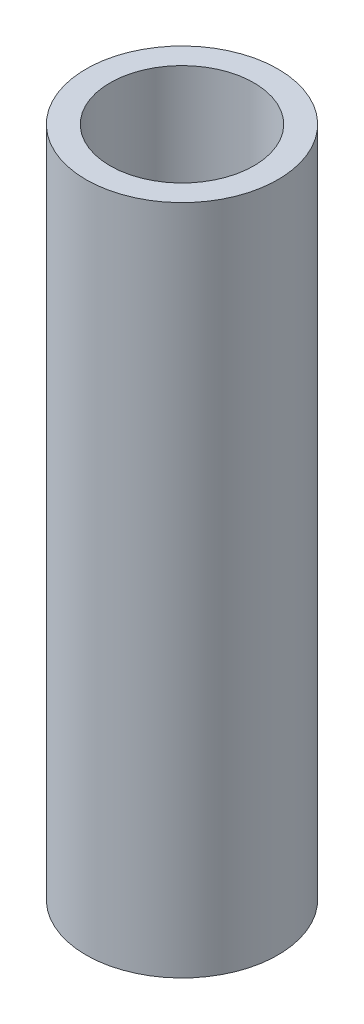
ISO-10303-21;
HEADER;
FILE_DESCRIPTION(('STEP AP214'),'2;1');
FILE_NAME('part.step','',(''),(''),'','','');
FILE_SCHEMA(('AUTOMOTIVE_DESIGN { 1 0 10303 214 1 1 1 1 }'));
ENDSEC;
DATA;
#1=APPLICATION_CONTEXT('core data for automotive mechanical design processes');
#2=APPLICATION_PROTOCOL_DEFINITION('international standard','automotive_design',2000,#1);
#3=PRODUCT_CONTEXT('',#1,'mechanical');
#4=PRODUCT('Part','Part','',(#3));
#5=PRODUCT_RELATED_PRODUCT_CATEGORY('part','',(#4));
#6=PRODUCT_DEFINITION_FORMATION('','',#4);
#7=PRODUCT_DEFINITION_CONTEXT('part definition',#1,'design');
#8=PRODUCT_DEFINITION('design','',#6,#7);
#9=PRODUCT_DEFINITION_SHAPE('','',#8);
#10=(LENGTH_UNIT() NAMED_UNIT(*) SI_UNIT(.MILLI.,.METRE.));
#11=(NAMED_UNIT(*) PLANE_ANGLE_UNIT() SI_UNIT($,.RADIAN.));
#12=(NAMED_UNIT(*) SI_UNIT($,.STERADIAN.) SOLID_ANGLE_UNIT());
#13=UNCERTAINTY_MEASURE_WITH_UNIT(LENGTH_MEASURE(1.E-05),#10,'distance_accuracy_value','');
#14=(GEOMETRIC_REPRESENTATION_CONTEXT(3) GLOBAL_UNCERTAINTY_ASSIGNED_CONTEXT((#13)) GLOBAL_UNIT_ASSIGNED_CONTEXT((#10,
#11,#12)) REPRESENTATION_CONTEXT('',''));
#15=CARTESIAN_POINT('',(0.,0.,0.));
#16=DIRECTION('',(0.,0.,1.));
#17=DIRECTION('',(1.,0.,0.));
#18=AXIS2_PLACEMENT_3D('',#15,#16,#17);
#19=CARTESIAN_POINT('',(-14.5675561179814,88.9,0.));
#20=DIRECTION('',(0.,1.,0.));
#21=DIRECTION('',(0.,0.,1.));
#22=AXIS2_PLACEMENT_3D('',#19,#20,#21);
#23=PLANE('',#22);
#24=CARTESIAN_POINT('',(-14.5675561179814,88.9,0.));
#25=DIRECTION('',(0.,1.,0.));
#26=DIRECTION('',(0.,0.,1.));
#27=AXIS2_PLACEMENT_3D('',#24,#25,#26);
#28=CIRCLE('',#27,12.7);
#29=CARTESIAN_POINT('',(-14.5675561179814,88.9,12.7));
#30=VERTEX_POINT('',#29);
#31=EDGE_CURVE('E10',#30,#30,#28,.T.);
#32=ORIENTED_EDGE('',*,*,#31,.T.);
#33=EDGE_LOOP('',(#32));
#34=FACE_BOUND('',#33,.T.);
#35=CARTESIAN_POINT('',(-14.5675561179814,88.9,0.));
#36=DIRECTION('',(0.,1.,0.));
#37=DIRECTION('',(0.,0.,1.));
#38=AXIS2_PLACEMENT_3D('',#35,#36,#37);
#39=CIRCLE('',#38,9.525);
#40=CARTESIAN_POINT('',(-14.5675561179814,88.9,9.525));
#41=VERTEX_POINT('',#40);
#42=EDGE_CURVE('E42',#41,#41,#39,.T.);
#43=ORIENTED_EDGE('',*,*,#42,.F.);
#44=EDGE_LOOP('',(#43));
#45=FACE_BOUND('',#44,.T.);
#46=ADVANCED_FACE('F31',(#34,#45),#23,.T.);
#47=CARTESIAN_POINT('',(-14.5675561179814,0.,0.));
#48=DIRECTION('',(0.,1.,0.));
#49=DIRECTION('',(0.,0.,1.));
#50=AXIS2_PLACEMENT_3D('',#47,#48,#49);
#51=PLANE('',#50);
#52=CARTESIAN_POINT('',(-14.5675561179814,0.,0.));
#53=DIRECTION('',(0.,1.,0.));
#54=DIRECTION('',(0.,0.,1.));
#55=AXIS2_PLACEMENT_3D('',#52,#53,#54);
#56=CIRCLE('',#55,12.7);
#57=CARTESIAN_POINT('',(-14.5675561179814,0.,12.7));
#58=VERTEX_POINT('',#57);
#59=EDGE_CURVE('E35',#58,#58,#56,.T.);
#60=ORIENTED_EDGE('',*,*,#59,.F.);
#61=EDGE_LOOP('',(#60));
#62=FACE_BOUND('',#61,.T.);
#63=CARTESIAN_POINT('',(-14.5675561179814,0.,0.));
#64=DIRECTION('',(0.,1.,0.));
#65=DIRECTION('',(0.,0.,1.));
#66=AXIS2_PLACEMENT_3D('',#63,#64,#65);
#67=CIRCLE('',#66,9.525);
#68=CARTESIAN_POINT('',(-14.5675561179814,0.,9.525));
#69=VERTEX_POINT('',#68);
#70=EDGE_CURVE('E44',#69,#69,#67,.T.);
#71=ORIENTED_EDGE('',*,*,#70,.T.);
#72=EDGE_LOOP('',(#71));
#73=FACE_BOUND('',#72,.T.);
#74=ADVANCED_FACE('F54',(#62,#73),#51,.F.);
#75=CARTESIAN_POINT('',(-14.5675561179814,88.9,0.));
#76=DIRECTION('',(0.,-1.,0.));
#77=DIRECTION('',(0.,0.,-1.));
#78=AXIS2_PLACEMENT_3D('',#75,#76,#77);
#79=CYLINDRICAL_SURFACE('',#78,12.7);
#80=ORIENTED_EDGE('',*,*,#31,.F.);
#81=EDGE_LOOP('',(#80));
#82=FACE_BOUND('',#81,.T.);
#83=ORIENTED_EDGE('',*,*,#59,.T.);
#84=EDGE_LOOP('',(#83));
#85=FACE_BOUND('',#84,.T.);
#86=ADVANCED_FACE('F33',(#82,#85),#79,.T.);
#87=CARTESIAN_POINT('',(-14.5675561179814,88.9,0.));
#88=DIRECTION('',(0.,-1.,0.));
#89=DIRECTION('',(0.,0.,-1.));
#90=AXIS2_PLACEMENT_3D('',#87,#88,#89);
#91=CYLINDRICAL_SURFACE('',#90,9.525);
#92=ORIENTED_EDGE('',*,*,#42,.T.);
#93=EDGE_LOOP('',(#92));
#94=FACE_BOUND('',#93,.T.);
#95=ORIENTED_EDGE('',*,*,#70,.F.);
#96=EDGE_LOOP('',(#95));
#97=FACE_BOUND('',#96,.T.);
#98=ADVANCED_FACE('F50',(#94,#97),#91,.F.);
#99=CLOSED_SHELL('',(#46,#74,#86,#98));
#100=MANIFOLD_SOLID_BREP('B2',#99);
#101=ADVANCED_BREP_SHAPE_REPRESENTATION('',(#18,#100),#14);
#102=SHAPE_DEFINITION_REPRESENTATION(#9,#101);
ENDSEC;
END-ISO-10303-21;
